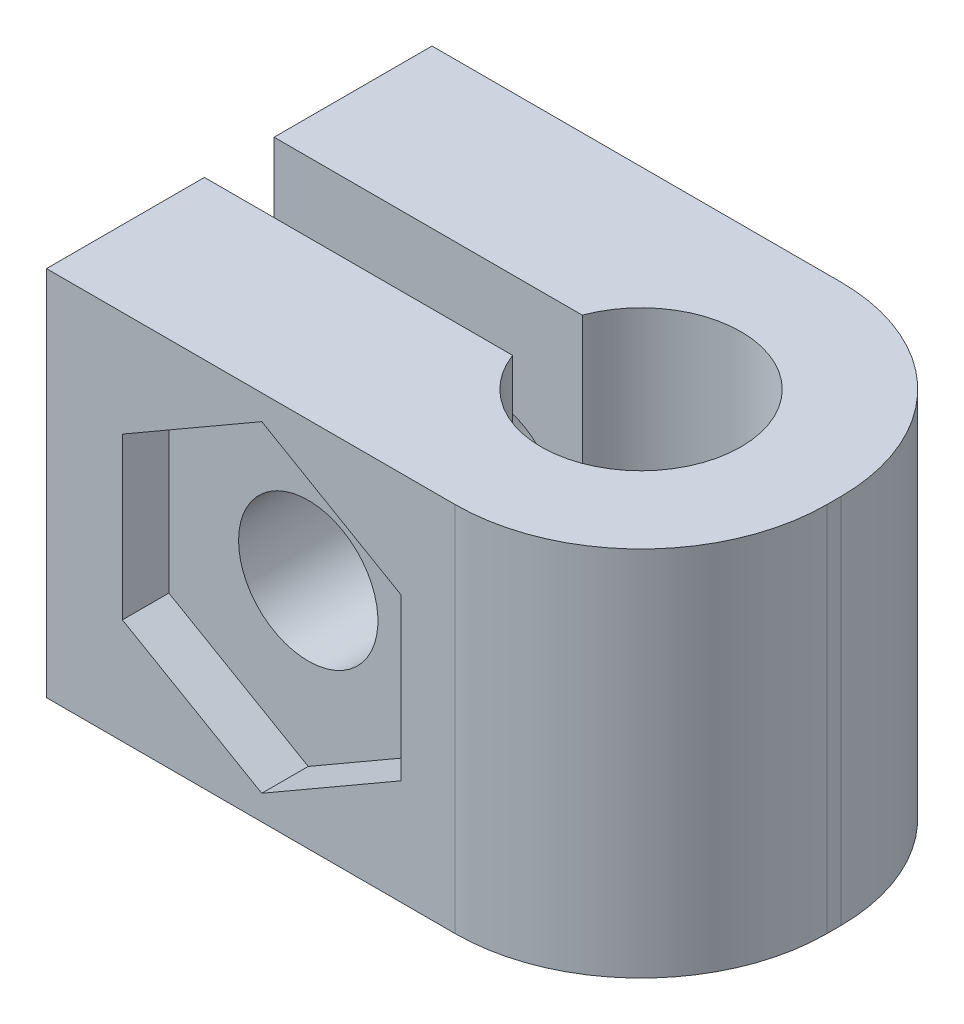
ISO-10303-21;
HEADER;
FILE_DESCRIPTION(('STEP AP214'),'2;1');
FILE_NAME('part.step','',(''),(''),'','','');
FILE_SCHEMA(('AUTOMOTIVE_DESIGN { 1 0 10303 214 1 1 1 1 }'));
ENDSEC;
DATA;
#1=APPLICATION_CONTEXT('core data for automotive mechanical design processes');
#2=APPLICATION_PROTOCOL_DEFINITION('international standard','automotive_design',2000,#1);
#3=PRODUCT_CONTEXT('',#1,'mechanical');
#4=PRODUCT('Part','Part','',(#3));
#5=PRODUCT_RELATED_PRODUCT_CATEGORY('part','',(#4));
#6=PRODUCT_DEFINITION_FORMATION('','',#4);
#7=PRODUCT_DEFINITION_CONTEXT('part definition',#1,'design');
#8=PRODUCT_DEFINITION('design','',#6,#7);
#9=PRODUCT_DEFINITION_SHAPE('','',#8);
#10=(LENGTH_UNIT() NAMED_UNIT(*) SI_UNIT(.MILLI.,.METRE.));
#11=(NAMED_UNIT(*) PLANE_ANGLE_UNIT() SI_UNIT($,.RADIAN.));
#12=(NAMED_UNIT(*) SI_UNIT($,.STERADIAN.) SOLID_ANGLE_UNIT());
#13=UNCERTAINTY_MEASURE_WITH_UNIT(LENGTH_MEASURE(1.E-05),#10,'distance_accuracy_value','');
#14=(GEOMETRIC_REPRESENTATION_CONTEXT(3) GLOBAL_UNCERTAINTY_ASSIGNED_CONTEXT((#13)) GLOBAL_UNIT_ASSIGNED_CONTEXT((#10,
#11,#12)) REPRESENTATION_CONTEXT('',''));
#15=CARTESIAN_POINT('',(0.,0.,0.));
#16=DIRECTION('',(0.,0.,1.));
#17=DIRECTION('',(1.,0.,0.));
#18=AXIS2_PLACEMENT_3D('',#15,#16,#17);
#19=CARTESIAN_POINT('',(-4.01494416796099,4.,-4.15));
#20=DIRECTION('',(0.,0.,1.));
#21=DIRECTION('',(1.,0.,0.));
#22=AXIS2_PLACEMENT_3D('',#19,#20,#21);
#23=CYLINDRICAL_SURFACE('',#22,1.5);
#24=CARTESIAN_POINT('',(-4.01494416796099,4.,-0.75));
#25=DIRECTION('',(0.,0.,-1.));
#26=DIRECTION('',(-1.,0.,0.));
#27=AXIS2_PLACEMENT_3D('',#24,#25,#26);
#28=CIRCLE('',#27,1.5);
#29=CARTESIAN_POINT('',(-5.51494416796099,4.,-0.75));
#30=VERTEX_POINT('',#29);
#31=EDGE_CURVE('E253',#30,#30,#28,.T.);
#32=ORIENTED_EDGE('',*,*,#31,.F.);
#33=EDGE_LOOP('',(#32));
#34=FACE_BOUND('',#33,.T.);
#35=CARTESIAN_POINT('',(-4.01494416796099,4.,-3.15));
#36=DIRECTION('',(0.,0.,-1.));
#37=DIRECTION('',(-1.,0.,0.));
#38=AXIS2_PLACEMENT_3D('',#35,#36,#37);
#39=CIRCLE('',#38,1.5);
#40=CARTESIAN_POINT('',(-5.51494416796099,4.,-3.15));
#41=VERTEX_POINT('',#40);
#42=EDGE_CURVE('E344',#41,#41,#39,.F.);
#43=ORIENTED_EDGE('',*,*,#42,.F.);
#44=EDGE_LOOP('',(#43));
#45=FACE_BOUND('',#44,.T.);
#46=ADVANCED_FACE('F66',(#34,#45),#23,.F.);
#47=CARTESIAN_POINT('',(-4.01494416796099,4.,0.75));
#48=DIRECTION('',(0.,0.,-1.));
#49=DIRECTION('',(-1.,0.,0.));
#50=AXIS2_PLACEMENT_3D('',#47,#48,#49);
#51=CIRCLE('',#50,1.5);
#52=CARTESIAN_POINT('',(-5.51494416796099,4.,0.75));
#53=VERTEX_POINT('',#52);
#54=EDGE_CURVE('E265',#53,#53,#51,.T.);
#55=ORIENTED_EDGE('',*,*,#54,.T.);
#56=EDGE_LOOP('',(#55));
#57=FACE_BOUND('',#56,.T.);
#58=CARTESIAN_POINT('',(-4.01494416796099,4.,3.15));
#59=DIRECTION('',(0.,0.,-1.));
#60=DIRECTION('',(-1.,0.,0.));
#61=AXIS2_PLACEMENT_3D('',#58,#59,#60);
#62=CIRCLE('',#61,1.5);
#63=CARTESIAN_POINT('',(-5.51494416796099,4.,3.15));
#64=VERTEX_POINT('',#63);
#65=EDGE_CURVE('E220',#64,#64,#62,.T.);
#66=ORIENTED_EDGE('',*,*,#65,.F.);
#67=EDGE_LOOP('',(#66));
#68=FACE_BOUND('',#67,.T.);
#69=ADVANCED_FACE('F415',(#57,#68),#23,.F.);
#70=CARTESIAN_POINT('',(0.,8.,0.));
#71=DIRECTION('',(0.,-1.,0.));
#72=DIRECTION('',(0.,0.,-1.));
#73=AXIS2_PLACEMENT_3D('',#70,#71,#72);
#74=CYLINDRICAL_SURFACE('',#73,2.15);
#75=CARTESIAN_POINT('',(0.,0.,0.));
#76=DIRECTION('',(0.,1.,0.));
#77=DIRECTION('',(0.,0.,1.));
#78=AXIS2_PLACEMENT_3D('',#75,#76,#77);
#79=CIRCLE('',#78,2.15);
#80=CARTESIAN_POINT('',(-2.01494416796099,0.,0.75));
#81=VERTEX_POINT('',#80);
#82=CARTESIAN_POINT('',(-2.01494416796099,0.,-0.75));
#83=VERTEX_POINT('',#82);
#84=EDGE_CURVE('E269',#81,#83,#79,.T.);
#85=ORIENTED_EDGE('',*,*,#84,.F.);
#86=DIRECTION('',(0.,-1.,0.));
#87=VECTOR('',#86,1.);
#88=CARTESIAN_POINT('',(-2.01494416796099,8.,0.75));
#89=LINE('',#88,#87);
#90=CARTESIAN_POINT('',(-2.01494416796099,8.,0.75));
#91=VERTEX_POINT('',#90);
#92=EDGE_CURVE('E337',#91,#81,#89,.T.);
#93=ORIENTED_EDGE('',*,*,#92,.F.);
#94=CARTESIAN_POINT('',(0.,8.,0.));
#95=DIRECTION('',(0.,1.,0.));
#96=DIRECTION('',(0.,0.,1.));
#97=AXIS2_PLACEMENT_3D('',#94,#95,#96);
#98=CIRCLE('',#97,2.15);
#99=CARTESIAN_POINT('',(-2.01494416796099,8.,-0.75));
#100=VERTEX_POINT('',#99);
#101=EDGE_CURVE('E270',#91,#100,#98,.T.);
#102=ORIENTED_EDGE('',*,*,#101,.T.);
#103=DIRECTION('',(0.,-1.,0.));
#104=VECTOR('',#103,1.);
#105=CARTESIAN_POINT('',(-2.01494416796099,8.,-0.75));
#106=LINE('',#105,#104);
#107=EDGE_CURVE('E296',#100,#83,#106,.T.);
#108=ORIENTED_EDGE('',*,*,#107,.T.);
#109=EDGE_LOOP('',(#85,#93,#102,#108));
#110=FACE_BOUND('',#109,.T.);
#111=ADVANCED_FACE('F391',(#110),#74,.F.);
#112=CARTESIAN_POINT('',(0.,8.,0.75));
#113=DIRECTION('',(0.,0.,-1.));
#114=DIRECTION('',(-1.,0.,0.));
#115=AXIS2_PLACEMENT_3D('',#112,#113,#114);
#116=PLANE('',#115);
#117=ORIENTED_EDGE('',*,*,#54,.F.);
#118=EDGE_LOOP('',(#117));
#119=FACE_BOUND('',#118,.T.);
#120=DIRECTION('',(1.,0.,0.));
#121=VECTOR('',#120,1.);
#122=CARTESIAN_POINT('',(0.,0.,0.75));
#123=LINE('',#122,#121);
#124=CARTESIAN_POINT('',(-8.65,0.,0.75));
#125=VERTEX_POINT('',#124);
#126=EDGE_CURVE('E300',#125,#81,#123,.T.);
#127=ORIENTED_EDGE('',*,*,#126,.F.);
#128=DIRECTION('',(0.,-1.,0.));
#129=VECTOR('',#128,1.);
#130=CARTESIAN_POINT('',(-8.65,8.,0.75));
#131=LINE('',#130,#129);
#132=CARTESIAN_POINT('',(-8.65,8.,0.75));
#133=VERTEX_POINT('',#132);
#134=EDGE_CURVE('E334',#133,#125,#131,.T.);
#135=ORIENTED_EDGE('',*,*,#134,.F.);
#136=DIRECTION('',(1.,0.,0.));
#137=VECTOR('',#136,1.);
#138=CARTESIAN_POINT('',(0.,8.,0.75));
#139=LINE('',#138,#137);
#140=EDGE_CURVE('E274',#133,#91,#139,.T.);
#141=ORIENTED_EDGE('',*,*,#140,.T.);
#142=ORIENTED_EDGE('',*,*,#92,.T.);
#143=EDGE_LOOP('',(#127,#135,#141,#142));
#144=FACE_BOUND('',#143,.T.);
#145=ADVANCED_FACE('F387',(#119,#144),#116,.T.);
#146=CARTESIAN_POINT('',(-8.65,8.,0.));
#147=DIRECTION('',(-1.,0.,0.));
#148=DIRECTION('',(0.,0.,1.));
#149=AXIS2_PLACEMENT_3D('',#146,#147,#148);
#150=PLANE('',#149);
#151=DIRECTION('',(0.,0.,-1.));
#152=VECTOR('',#151,1.);
#153=CARTESIAN_POINT('',(-8.65,0.,0.));
#154=LINE('',#153,#152);
#155=CARTESIAN_POINT('',(-8.65,0.,4.15));
#156=VERTEX_POINT('',#155);
#157=EDGE_CURVE('E304',#156,#125,#154,.T.);
#158=ORIENTED_EDGE('',*,*,#157,.F.);
#159=DIRECTION('',(0.,-1.,0.));
#160=VECTOR('',#159,1.);
#161=CARTESIAN_POINT('',(-8.65,8.,4.15));
#162=LINE('',#161,#160);
#163=CARTESIAN_POINT('',(-8.65,8.,4.15));
#164=VERTEX_POINT('',#163);
#165=EDGE_CURVE('E331',#164,#156,#162,.T.);
#166=ORIENTED_EDGE('',*,*,#165,.F.);
#167=DIRECTION('',(0.,0.,-1.));
#168=VECTOR('',#167,1.);
#169=CARTESIAN_POINT('',(-8.65,8.,0.));
#170=LINE('',#169,#168);
#171=EDGE_CURVE('E279',#164,#133,#170,.T.);
#172=ORIENTED_EDGE('',*,*,#171,.T.);
#173=ORIENTED_EDGE('',*,*,#134,.T.);
#174=EDGE_LOOP('',(#158,#166,#172,#173));
#175=FACE_BOUND('',#174,.T.);
#176=ADVANCED_FACE('F382',(#175),#150,.T.);
#177=CARTESIAN_POINT('',(0.,8.,4.15));
#178=DIRECTION('',(0.,0.,-1.));
#179=DIRECTION('',(-1.,0.,0.));
#180=AXIS2_PLACEMENT_3D('',#177,#178,#179);
#181=PLANE('',#180);
#182=DIRECTION('',(0.,1.,0.));
#183=VECTOR('',#182,1.);
#184=CARTESIAN_POINT('',(-1.01494416796099,8.,4.15));
#185=LINE('',#184,#183);
#186=CARTESIAN_POINT('',(-1.01494416796099,2.26794919243112,4.15));
#187=VERTEX_POINT('',#186);
#188=CARTESIAN_POINT('',(-1.01494416796099,5.73205080756888,4.15));
#189=VERTEX_POINT('',#188);
#190=EDGE_CURVE('E236',#187,#189,#185,.T.);
#191=ORIENTED_EDGE('',*,*,#190,.F.);
#192=DIRECTION('',(0.866025403784439,0.5,0.));
#193=VECTOR('',#192,1.);
#194=CARTESIAN_POINT('',(2.22831476557863,4.14044561076188,4.15));
#195=LINE('',#194,#193);
#196=CARTESIAN_POINT('',(-4.01494416796099,0.535898384862246,4.15));
#197=VERTEX_POINT('',#196);
#198=EDGE_CURVE('E191',#197,#187,#195,.T.);
#199=ORIENTED_EDGE('',*,*,#198,.F.);
#200=DIRECTION('',(0.866025403784439,-0.5,0.));
#201=VECTOR('',#200,1.);
#202=CARTESIAN_POINT('',(-4.23578684955913,0.663401966531489,4.15));
#203=LINE('',#202,#201);
#204=CARTESIAN_POINT('',(-7.01494416796099,2.26794919243113,4.15));
#205=VERTEX_POINT('',#204);
#206=EDGE_CURVE('E213',#205,#197,#203,.T.);
#207=ORIENTED_EDGE('',*,*,#206,.F.);
#208=DIRECTION('',(0.,-1.,0.));
#209=VECTOR('',#208,1.);
#210=CARTESIAN_POINT('',(-7.01494416796099,8.,4.15));
#211=LINE('',#210,#209);
#212=CARTESIAN_POINT('',(-7.01494416796099,5.73205080756888,4.15));
#213=VERTEX_POINT('',#212);
#214=EDGE_CURVE('E217',#213,#205,#211,.T.);
#215=ORIENTED_EDGE('',*,*,#214,.F.);
#216=DIRECTION('',(-0.866025403784438,-0.500000000000001,0.));
#217=VECTOR('',#216,1.);
#218=CARTESIAN_POINT('',(-0.771685234421373,9.33659803346852,4.15));
#219=LINE('',#218,#217);
#220=CARTESIAN_POINT('',(-4.01494416796099,7.46410161513776,4.15));
#221=VERTEX_POINT('',#220);
#222=EDGE_CURVE('E243',#221,#213,#219,.T.);
#223=ORIENTED_EDGE('',*,*,#222,.F.);
#224=DIRECTION('',(-0.866025403784439,0.5,0.));
#225=VECTOR('',#224,1.);
#226=CARTESIAN_POINT('',(-1.23578684955912,5.85955438923812,4.15));
#227=LINE('',#226,#225);
#228=EDGE_CURVE('E239',#189,#221,#227,.T.);
#229=ORIENTED_EDGE('',*,*,#228,.F.);
#230=EDGE_LOOP('',(#191,#199,#207,#215,#223,#229));
#231=FACE_BOUND('',#230,.T.);
#232=DIRECTION('',(1.,0.,0.));
#233=VECTOR('',#232,1.);
#234=CARTESIAN_POINT('',(0.,0.,4.15));
#235=LINE('',#234,#233);
#236=CARTESIAN_POINT('',(0.15,0.,4.15));
#237=VERTEX_POINT('',#236);
#238=EDGE_CURVE('E308',#156,#237,#235,.T.);
#239=ORIENTED_EDGE('',*,*,#238,.T.);
#240=DIRECTION('',(0.,-1.,0.));
#241=VECTOR('',#240,1.);
#242=CARTESIAN_POINT('',(0.15,8.,4.15));
#243=LINE('',#242,#241);
#244=CARTESIAN_POINT('',(0.15,8.,4.15));
#245=VERTEX_POINT('',#244);
#246=EDGE_CURVE('E90',#237,#245,#243,.F.);
#247=ORIENTED_EDGE('',*,*,#246,.T.);
#248=DIRECTION('',(1.,0.,0.));
#249=VECTOR('',#248,1.);
#250=CARTESIAN_POINT('',(0.,8.,4.15));
#251=LINE('',#250,#249);
#252=EDGE_CURVE('E283',#164,#245,#251,.T.);
#253=ORIENTED_EDGE('',*,*,#252,.F.);
#254=ORIENTED_EDGE('',*,*,#165,.T.);
#255=EDGE_LOOP('',(#239,#247,#253,#254));
#256=FACE_BOUND('',#255,.T.);
#257=ADVANCED_FACE('F380',(#231,#256),#181,.F.);
#258=CARTESIAN_POINT('',(4.15,8.,0.));
#259=DIRECTION('',(-1.,0.,0.));
#260=DIRECTION('',(0.,0.,1.));
#261=AXIS2_PLACEMENT_3D('',#258,#259,#260);
#262=PLANE('',#261);
#263=DIRECTION('',(0.,0.,-1.));
#264=VECTOR('',#263,1.);
#265=CARTESIAN_POINT('',(4.15,8.,0.));
#266=LINE('',#265,#264);
#267=CARTESIAN_POINT('',(4.15,8.,0.15));
#268=VERTEX_POINT('',#267);
#269=CARTESIAN_POINT('',(4.15,8.,-0.150000000000001));
#270=VERTEX_POINT('',#269);
#271=EDGE_CURVE('E287',#268,#270,#266,.T.);
#272=ORIENTED_EDGE('',*,*,#271,.F.);
#273=DIRECTION('',(0.,-1.,0.));
#274=VECTOR('',#273,1.);
#275=CARTESIAN_POINT('',(4.15,8.,0.15));
#276=LINE('',#275,#274);
#277=CARTESIAN_POINT('',(4.15,0.,0.15));
#278=VERTEX_POINT('',#277);
#279=EDGE_CURVE('E351',#268,#278,#276,.T.);
#280=ORIENTED_EDGE('',*,*,#279,.T.);
#281=DIRECTION('',(0.,0.,-1.));
#282=VECTOR('',#281,1.);
#283=CARTESIAN_POINT('',(4.15,0.,0.));
#284=LINE('',#283,#282);
#285=CARTESIAN_POINT('',(4.15,0.,-0.150000000000001));
#286=VERTEX_POINT('',#285);
#287=EDGE_CURVE('E312',#278,#286,#284,.T.);
#288=ORIENTED_EDGE('',*,*,#287,.T.);
#289=DIRECTION('',(0.,-1.,0.));
#290=VECTOR('',#289,1.);
#291=CARTESIAN_POINT('',(4.15,8.,-0.150000000000001));
#292=LINE('',#291,#290);
#293=EDGE_CURVE('E340',#286,#270,#292,.F.);
#294=ORIENTED_EDGE('',*,*,#293,.T.);
#295=EDGE_LOOP('',(#272,#280,#288,#294));
#296=FACE_BOUND('',#295,.T.);
#297=ADVANCED_FACE('F372',(#296),#262,.F.);
#298=CARTESIAN_POINT('',(0.,8.,-4.15));
#299=DIRECTION('',(0.,0.,-1.));
#300=DIRECTION('',(-1.,0.,0.));
#301=AXIS2_PLACEMENT_3D('',#298,#299,#300);
#302=PLANE('',#301);
#303=CARTESIAN_POINT('',(-4.01494416796099,4.,-4.15));
#304=DIRECTION('',(0.,0.,-1.));
#305=DIRECTION('',(-1.,0.,0.));
#306=AXIS2_PLACEMENT_3D('',#303,#304,#305);
#307=CIRCLE('',#306,3.);
#308=CARTESIAN_POINT('',(-7.01494416796099,4.,-4.15));
#309=VERTEX_POINT('',#308);
#310=EDGE_CURVE('E664',#309,#309,#307,.T.);
#311=ORIENTED_EDGE('',*,*,#310,.F.);
#312=EDGE_LOOP('',(#311));
#313=FACE_BOUND('',#312,.T.);
#314=DIRECTION('',(1.,0.,0.));
#315=VECTOR('',#314,1.);
#316=CARTESIAN_POINT('',(0.,8.,-4.15));
#317=LINE('',#316,#315);
#318=CARTESIAN_POINT('',(-8.65000000000001,8.,-4.15));
#319=VERTEX_POINT('',#318);
#320=CARTESIAN_POINT('',(0.149999999999999,8.,-4.15));
#321=VERTEX_POINT('',#320);
#322=EDGE_CURVE('E290',#319,#321,#317,.T.);
#323=ORIENTED_EDGE('',*,*,#322,.T.);
#324=DIRECTION('',(0.,-1.,0.));
#325=VECTOR('',#324,1.);
#326=CARTESIAN_POINT('',(0.149999999999999,0.,-4.15));
#327=LINE('',#326,#325);
#328=CARTESIAN_POINT('',(0.149999999999999,0.,-4.15));
#329=VERTEX_POINT('',#328);
#330=EDGE_CURVE('E12',#321,#329,#327,.T.);
#331=ORIENTED_EDGE('',*,*,#330,.T.);
#332=DIRECTION('',(1.,0.,0.));
#333=VECTOR('',#332,1.);
#334=CARTESIAN_POINT('',(0.,0.,-4.15));
#335=LINE('',#334,#333);
#336=CARTESIAN_POINT('',(-8.65000000000001,0.,-4.15));
#337=VERTEX_POINT('',#336);
#338=EDGE_CURVE('E316',#337,#329,#335,.T.);
#339=ORIENTED_EDGE('',*,*,#338,.F.);
#340=DIRECTION('',(0.,-1.,0.));
#341=VECTOR('',#340,1.);
#342=CARTESIAN_POINT('',(-8.65000000000001,8.,-4.15));
#343=LINE('',#342,#341);
#344=EDGE_CURVE('E328',#319,#337,#343,.T.);
#345=ORIENTED_EDGE('',*,*,#344,.F.);
#346=EDGE_LOOP('',(#323,#331,#339,#345));
#347=FACE_BOUND('',#346,.T.);
#348=ADVANCED_FACE('F407',(#313,#347),#302,.T.);
#349=CARTESIAN_POINT('',(-8.65,0.,-0.75));
#350=VERTEX_POINT('',#349);
#351=EDGE_CURVE('E309',#350,#337,#154,.T.);
#352=ORIENTED_EDGE('',*,*,#351,.F.);
#353=DIRECTION('',(0.,-1.,0.));
#354=VECTOR('',#353,1.);
#355=CARTESIAN_POINT('',(-8.65,8.,-0.75));
#356=LINE('',#355,#354);
#357=CARTESIAN_POINT('',(-8.65,8.,-0.75));
#358=VERTEX_POINT('',#357);
#359=EDGE_CURVE('E325',#358,#350,#356,.T.);
#360=ORIENTED_EDGE('',*,*,#359,.F.);
#361=EDGE_CURVE('E284',#358,#319,#170,.T.);
#362=ORIENTED_EDGE('',*,*,#361,.T.);
#363=ORIENTED_EDGE('',*,*,#344,.T.);
#364=EDGE_LOOP('',(#352,#360,#362,#363));
#365=FACE_BOUND('',#364,.T.);
#366=ADVANCED_FACE('F399',(#365),#150,.T.);
#367=CARTESIAN_POINT('',(0.,8.,-0.75));
#368=DIRECTION('',(0.,0.,-1.));
#369=DIRECTION('',(-1.,0.,0.));
#370=AXIS2_PLACEMENT_3D('',#367,#368,#369);
#371=PLANE('',#370);
#372=ORIENTED_EDGE('',*,*,#31,.T.);
#373=EDGE_LOOP('',(#372));
#374=FACE_BOUND('',#373,.T.);
#375=DIRECTION('',(1.,0.,0.));
#376=VECTOR('',#375,1.);
#377=CARTESIAN_POINT('',(0.,0.,-0.75));
#378=LINE('',#377,#376);
#379=EDGE_CURVE('E275',#350,#83,#378,.T.);
#380=ORIENTED_EDGE('',*,*,#379,.T.);
#381=ORIENTED_EDGE('',*,*,#107,.F.);
#382=DIRECTION('',(1.,0.,0.));
#383=VECTOR('',#382,1.);
#384=CARTESIAN_POINT('',(0.,8.,-0.75));
#385=LINE('',#384,#383);
#386=EDGE_CURVE('E293',#358,#100,#385,.T.);
#387=ORIENTED_EDGE('',*,*,#386,.F.);
#388=ORIENTED_EDGE('',*,*,#359,.T.);
#389=EDGE_LOOP('',(#380,#381,#387,#388));
#390=FACE_BOUND('',#389,.T.);
#391=ADVANCED_FACE('F395',(#374,#390),#371,.F.);
#392=CARTESIAN_POINT('',(0.,8.,0.));
#393=DIRECTION('',(0.,1.,0.));
#394=DIRECTION('',(0.,0.,1.));
#395=AXIS2_PLACEMENT_3D('',#392,#393,#394);
#396=PLANE('',#395);
#397=ORIENTED_EDGE('',*,*,#252,.T.);
#398=CARTESIAN_POINT('',(0.15,8.,0.15));
#399=DIRECTION('',(0.,1.,0.));
#400=DIRECTION('',(0.,0.,1.));
#401=AXIS2_PLACEMENT_3D('',#398,#399,#400);
#402=CIRCLE('',#401,4.);
#403=EDGE_CURVE('E75',#245,#268,#402,.T.);
#404=ORIENTED_EDGE('',*,*,#403,.T.);
#405=ORIENTED_EDGE('',*,*,#271,.T.);
#406=CARTESIAN_POINT('',(0.15,8.,-0.150000000000001));
#407=DIRECTION('',(0.,1.,0.));
#408=DIRECTION('',(0.,0.,1.));
#409=AXIS2_PLACEMENT_3D('',#406,#407,#408);
#410=CIRCLE('',#409,4.);
#411=EDGE_CURVE('E82',#270,#321,#410,.T.);
#412=ORIENTED_EDGE('',*,*,#411,.T.);
#413=ORIENTED_EDGE('',*,*,#322,.F.);
#414=ORIENTED_EDGE('',*,*,#361,.F.);
#415=ORIENTED_EDGE('',*,*,#386,.T.);
#416=ORIENTED_EDGE('',*,*,#101,.F.);
#417=ORIENTED_EDGE('',*,*,#140,.F.);
#418=ORIENTED_EDGE('',*,*,#171,.F.);
#419=EDGE_LOOP('',(#397,#404,#405,#412,#413,#414,#415,#416,#417,#418));
#420=FACE_BOUND('',#419,.T.);
#421=ADVANCED_FACE('F367',(#420),#396,.T.);
#422=CARTESIAN_POINT('',(0.,0.,0.));
#423=DIRECTION('',(0.,1.,0.));
#424=DIRECTION('',(0.,0.,1.));
#425=AXIS2_PLACEMENT_3D('',#422,#423,#424);
#426=PLANE('',#425);
#427=ORIENTED_EDGE('',*,*,#287,.F.);
#428=CARTESIAN_POINT('',(0.15,0.,0.15));
#429=DIRECTION('',(0.,1.,0.));
#430=DIRECTION('',(0.,0.,1.));
#431=AXIS2_PLACEMENT_3D('',#428,#429,#430);
#432=CIRCLE('',#431,4.);
#433=EDGE_CURVE('E358',#278,#237,#432,.F.);
#434=ORIENTED_EDGE('',*,*,#433,.T.);
#435=ORIENTED_EDGE('',*,*,#238,.F.);
#436=ORIENTED_EDGE('',*,*,#157,.T.);
#437=ORIENTED_EDGE('',*,*,#126,.T.);
#438=ORIENTED_EDGE('',*,*,#84,.T.);
#439=ORIENTED_EDGE('',*,*,#379,.F.);
#440=ORIENTED_EDGE('',*,*,#351,.T.);
#441=ORIENTED_EDGE('',*,*,#338,.T.);
#442=CARTESIAN_POINT('',(0.15,0.,-0.150000000000001));
#443=DIRECTION('',(0.,1.,0.));
#444=DIRECTION('',(0.,0.,1.));
#445=AXIS2_PLACEMENT_3D('',#442,#443,#444);
#446=CIRCLE('',#445,4.);
#447=EDGE_CURVE('E355',#329,#286,#446,.F.);
#448=ORIENTED_EDGE('',*,*,#447,.T.);
#449=EDGE_LOOP('',(#427,#434,#435,#436,#437,#438,#439,#440,#441,#448));
#450=FACE_BOUND('',#449,.T.);
#451=ADVANCED_FACE('F378',(#450),#426,.F.);
#452=CARTESIAN_POINT('',(0.,0.,3.15));
#453=DIRECTION('',(0.,0.,1.));
#454=DIRECTION('',(1.,0.,0.));
#455=AXIS2_PLACEMENT_3D('',#452,#453,#454);
#456=PLANE('',#455);
#457=DIRECTION('',(0.866025403784439,0.5,0.));
#458=VECTOR('',#457,1.);
#459=CARTESIAN_POINT('',(2.22831476557863,4.14044561076188,3.15));
#460=LINE('',#459,#458);
#461=CARTESIAN_POINT('',(-4.01494416796099,0.535898384862246,3.15));
#462=VERTEX_POINT('',#461);
#463=CARTESIAN_POINT('',(-1.01494416796099,2.26794919243112,3.15));
#464=VERTEX_POINT('',#463);
#465=EDGE_CURVE('E188',#462,#464,#460,.T.);
#466=ORIENTED_EDGE('',*,*,#465,.T.);
#467=DIRECTION('',(0.,1.,0.));
#468=VECTOR('',#467,1.);
#469=CARTESIAN_POINT('',(-1.01494416796099,8.,3.15));
#470=LINE('',#469,#468);
#471=CARTESIAN_POINT('',(-1.01494416796099,5.73205080756888,3.15));
#472=VERTEX_POINT('',#471);
#473=EDGE_CURVE('E200',#464,#472,#470,.T.);
#474=ORIENTED_EDGE('',*,*,#473,.T.);
#475=DIRECTION('',(-0.866025403784439,0.5,0.));
#476=VECTOR('',#475,1.);
#477=CARTESIAN_POINT('',(-1.23578684955912,5.85955438923812,3.15));
#478=LINE('',#477,#476);
#479=CARTESIAN_POINT('',(-4.01494416796099,7.46410161513776,3.15));
#480=VERTEX_POINT('',#479);
#481=EDGE_CURVE('E206',#472,#480,#478,.T.);
#482=ORIENTED_EDGE('',*,*,#481,.T.);
#483=DIRECTION('',(-0.866025403784438,-0.500000000000001,0.));
#484=VECTOR('',#483,1.);
#485=CARTESIAN_POINT('',(-0.771685234421373,9.33659803346852,3.15));
#486=LINE('',#485,#484);
#487=CARTESIAN_POINT('',(-7.01494416796099,5.73205080756888,3.15));
#488=VERTEX_POINT('',#487);
#489=EDGE_CURVE('E225',#480,#488,#486,.T.);
#490=ORIENTED_EDGE('',*,*,#489,.T.);
#491=DIRECTION('',(0.,-1.,0.));
#492=VECTOR('',#491,1.);
#493=CARTESIAN_POINT('',(-7.01494416796099,8.,3.15));
#494=LINE('',#493,#492);
#495=CARTESIAN_POINT('',(-7.01494416796099,2.26794919243113,3.15));
#496=VERTEX_POINT('',#495);
#497=EDGE_CURVE('E229',#488,#496,#494,.T.);
#498=ORIENTED_EDGE('',*,*,#497,.T.);
#499=DIRECTION('',(0.866025403784439,-0.5,0.));
#500=VECTOR('',#499,1.);
#501=CARTESIAN_POINT('',(-4.23578684955913,0.663401966531489,3.15));
#502=LINE('',#501,#500);
#503=EDGE_CURVE('E197',#496,#462,#502,.T.);
#504=ORIENTED_EDGE('',*,*,#503,.T.);
#505=EDGE_LOOP('',(#466,#474,#482,#490,#498,#504));
#506=FACE_BOUND('',#505,.T.);
#507=ORIENTED_EDGE('',*,*,#65,.T.);
#508=EDGE_LOOP('',(#507));
#509=FACE_BOUND('',#508,.T.);
#510=ADVANCED_FACE('F208',(#506,#509),#456,.T.);
#511=CARTESIAN_POINT('',(2.22831476557863,4.14044561076188,3.15));
#512=DIRECTION('',(0.5,-0.866025403784439,0.));
#513=DIRECTION('',(0.866025403784439,0.5,0.));
#514=AXIS2_PLACEMENT_3D('',#511,#512,#513);
#515=PLANE('',#514);
#516=ORIENTED_EDGE('',*,*,#198,.T.);
#517=DIRECTION('',(0.,0.,1.));
#518=VECTOR('',#517,1.);
#519=CARTESIAN_POINT('',(-1.01494416796099,2.26794919243112,3.15));
#520=LINE('',#519,#518);
#521=EDGE_CURVE('E184',#464,#187,#520,.T.);
#522=ORIENTED_EDGE('',*,*,#521,.F.);
#523=ORIENTED_EDGE('',*,*,#465,.F.);
#524=DIRECTION('',(0.,0.,1.));
#525=VECTOR('',#524,1.);
#526=CARTESIAN_POINT('',(-4.01494416796099,0.535898384862246,3.15));
#527=LINE('',#526,#525);
#528=EDGE_CURVE('E250',#462,#197,#527,.T.);
#529=ORIENTED_EDGE('',*,*,#528,.T.);
#530=EDGE_LOOP('',(#516,#522,#523,#529));
#531=FACE_BOUND('',#530,.T.);
#532=ADVANCED_FACE('F186',(#531),#515,.F.);
#533=CARTESIAN_POINT('',(-4.23578684955913,0.663401966531489,3.15));
#534=DIRECTION('',(-0.5,-0.866025403784438,0.));
#535=DIRECTION('',(0.866025403784439,-0.5,0.));
#536=AXIS2_PLACEMENT_3D('',#533,#534,#535);
#537=PLANE('',#536);
#538=ORIENTED_EDGE('',*,*,#206,.T.);
#539=ORIENTED_EDGE('',*,*,#528,.F.);
#540=ORIENTED_EDGE('',*,*,#503,.F.);
#541=DIRECTION('',(0.,0.,1.));
#542=VECTOR('',#541,1.);
#543=CARTESIAN_POINT('',(-7.01494416796099,2.26794919243113,3.15));
#544=LINE('',#543,#542);
#545=EDGE_CURVE('E254',#496,#205,#544,.T.);
#546=ORIENTED_EDGE('',*,*,#545,.T.);
#547=EDGE_LOOP('',(#538,#539,#540,#546));
#548=FACE_BOUND('',#547,.T.);
#549=ADVANCED_FACE('F503',(#548),#537,.F.);
#550=CARTESIAN_POINT('',(-7.01494416796099,8.,3.15));
#551=DIRECTION('',(-1.,0.,0.));
#552=DIRECTION('',(0.,-1.,0.));
#553=AXIS2_PLACEMENT_3D('',#550,#551,#552);
#554=PLANE('',#553);
#555=ORIENTED_EDGE('',*,*,#214,.T.);
#556=ORIENTED_EDGE('',*,*,#545,.F.);
#557=ORIENTED_EDGE('',*,*,#497,.F.);
#558=DIRECTION('',(0.,0.,1.));
#559=VECTOR('',#558,1.);
#560=CARTESIAN_POINT('',(-7.01494416796099,5.73205080756888,3.15));
#561=LINE('',#560,#559);
#562=EDGE_CURVE('E257',#488,#213,#561,.T.);
#563=ORIENTED_EDGE('',*,*,#562,.T.);
#564=EDGE_LOOP('',(#555,#556,#557,#563));
#565=FACE_BOUND('',#564,.T.);
#566=ADVANCED_FACE('F509',(#565),#554,.F.);
#567=CARTESIAN_POINT('',(-0.771685234421373,9.33659803346852,3.15));
#568=DIRECTION('',(-0.500000000000001,0.866025403784438,0.));
#569=DIRECTION('',(-0.866025403784438,-0.500000000000001,0.));
#570=AXIS2_PLACEMENT_3D('',#567,#568,#569);
#571=PLANE('',#570);
#572=ORIENTED_EDGE('',*,*,#222,.T.);
#573=ORIENTED_EDGE('',*,*,#562,.F.);
#574=ORIENTED_EDGE('',*,*,#489,.F.);
#575=DIRECTION('',(0.,0.,1.));
#576=VECTOR('',#575,1.);
#577=CARTESIAN_POINT('',(-4.01494416796099,7.46410161513776,3.15));
#578=LINE('',#577,#576);
#579=EDGE_CURVE('E260',#480,#221,#578,.T.);
#580=ORIENTED_EDGE('',*,*,#579,.T.);
#581=EDGE_LOOP('',(#572,#573,#574,#580));
#582=FACE_BOUND('',#581,.T.);
#583=ADVANCED_FACE('F517',(#582),#571,.F.);
#584=CARTESIAN_POINT('',(-1.23578684955912,5.85955438923812,3.15));
#585=DIRECTION('',(0.5,0.866025403784439,0.));
#586=DIRECTION('',(-0.866025403784439,0.5,0.));
#587=AXIS2_PLACEMENT_3D('',#584,#585,#586);
#588=PLANE('',#587);
#589=ORIENTED_EDGE('',*,*,#228,.T.);
#590=ORIENTED_EDGE('',*,*,#579,.F.);
#591=ORIENTED_EDGE('',*,*,#481,.F.);
#592=DIRECTION('',(0.,0.,1.));
#593=VECTOR('',#592,1.);
#594=CARTESIAN_POINT('',(-1.01494416796099,5.73205080756888,3.15));
#595=LINE('',#594,#593);
#596=EDGE_CURVE('E196',#472,#189,#595,.T.);
#597=ORIENTED_EDGE('',*,*,#596,.T.);
#598=EDGE_LOOP('',(#589,#590,#591,#597));
#599=FACE_BOUND('',#598,.T.);
#600=ADVANCED_FACE('F525',(#599),#588,.F.);
#601=CARTESIAN_POINT('',(-1.01494416796099,8.,3.15));
#602=DIRECTION('',(1.,0.,0.));
#603=DIRECTION('',(0.,0.,-1.));
#604=AXIS2_PLACEMENT_3D('',#601,#602,#603);
#605=PLANE('',#604);
#606=ORIENTED_EDGE('',*,*,#190,.T.);
#607=ORIENTED_EDGE('',*,*,#596,.F.);
#608=ORIENTED_EDGE('',*,*,#473,.F.);
#609=ORIENTED_EDGE('',*,*,#521,.T.);
#610=EDGE_LOOP('',(#606,#607,#608,#609));
#611=FACE_BOUND('',#610,.T.);
#612=ADVANCED_FACE('F201',(#611),#605,.F.);
#613=CARTESIAN_POINT('',(-4.01494416796099,4.,-3.15));
#614=DIRECTION('',(0.,0.,-1.));
#615=DIRECTION('',(-1.,0.,0.));
#616=AXIS2_PLACEMENT_3D('',#613,#614,#615);
#617=PLANE('',#616);
#618=CARTESIAN_POINT('',(-4.01494416796099,4.,-3.15));
#619=DIRECTION('',(0.,0.,-1.));
#620=DIRECTION('',(-1.,0.,0.));
#621=AXIS2_PLACEMENT_3D('',#618,#619,#620);
#622=CIRCLE('',#621,3.);
#623=CARTESIAN_POINT('',(-7.01494416796099,4.,-3.15));
#624=VERTEX_POINT('',#623);
#625=EDGE_CURVE('E348',#624,#624,#622,.T.);
#626=ORIENTED_EDGE('',*,*,#625,.T.);
#627=EDGE_LOOP('',(#626));
#628=FACE_BOUND('',#627,.T.);
#629=ORIENTED_EDGE('',*,*,#42,.T.);
#630=EDGE_LOOP('',(#629));
#631=FACE_BOUND('',#630,.T.);
#632=ADVANCED_FACE('F540',(#628,#631),#617,.T.);
#633=CARTESIAN_POINT('',(-4.01494416796099,4.,-3.15));
#634=DIRECTION('',(0.,0.,-1.));
#635=DIRECTION('',(-1.,0.,0.));
#636=AXIS2_PLACEMENT_3D('',#633,#634,#635);
#637=CYLINDRICAL_SURFACE('',#636,3.);
#638=ORIENTED_EDGE('',*,*,#625,.F.);
#639=EDGE_LOOP('',(#638));
#640=FACE_BOUND('',#639,.T.);
#641=ORIENTED_EDGE('',*,*,#310,.T.);
#642=EDGE_LOOP('',(#641));
#643=FACE_BOUND('',#642,.T.);
#644=ADVANCED_FACE('F413',(#640,#643),#637,.F.);
#645=CARTESIAN_POINT('',(0.15,8.,0.15));
#646=DIRECTION('',(0.,-1.,0.));
#647=DIRECTION('',(0.,0.,-1.));
#648=AXIS2_PLACEMENT_3D('',#645,#646,#647);
#649=CYLINDRICAL_SURFACE('',#648,4.);
#650=ORIENTED_EDGE('',*,*,#403,.F.);
#651=ORIENTED_EDGE('',*,*,#246,.F.);
#652=ORIENTED_EDGE('',*,*,#433,.F.);
#653=ORIENTED_EDGE('',*,*,#279,.F.);
#654=EDGE_LOOP('',(#650,#651,#652,#653));
#655=FACE_BOUND('',#654,.T.);
#656=ADVANCED_FACE('F375',(#655),#649,.T.);
#657=CARTESIAN_POINT('',(0.15,8.,-0.150000000000001));
#658=DIRECTION('',(0.,1.,0.));
#659=DIRECTION('',(0.,0.,1.));
#660=AXIS2_PLACEMENT_3D('',#657,#658,#659);
#661=CYLINDRICAL_SURFACE('',#660,4.);
#662=ORIENTED_EDGE('',*,*,#411,.F.);
#663=ORIENTED_EDGE('',*,*,#293,.F.);
#664=ORIENTED_EDGE('',*,*,#447,.F.);
#665=ORIENTED_EDGE('',*,*,#330,.F.);
#666=EDGE_LOOP('',(#662,#663,#664,#665));
#667=FACE_BOUND('',#666,.T.);
#668=ADVANCED_FACE('F68',(#667),#661,.T.);
#669=CLOSED_SHELL('',(#46,#69,#111,#145,#176,#257,#297,#348,#366,#391,#421,#451,#510,#532,#549,
#566,#583,#600,#612,#632,#644,#656,#668));
#670=MANIFOLD_SOLID_BREP('B2',#669);
#671=ADVANCED_BREP_SHAPE_REPRESENTATION('',(#18,#670),#14);
#672=SHAPE_DEFINITION_REPRESENTATION(#9,#671);
ENDSEC;
END-ISO-10303-21;
